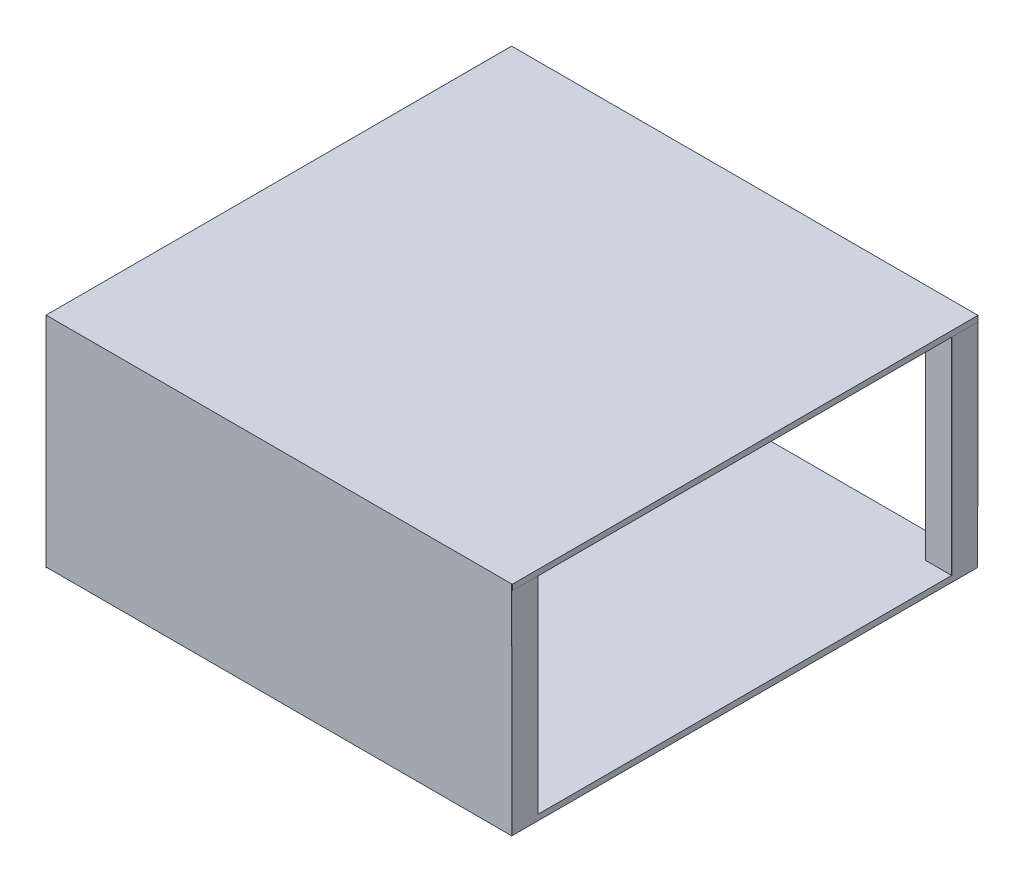
ISO-10303-21;
HEADER;
FILE_DESCRIPTION(('STEP AP214'),'2;1');
FILE_NAME('part.step','',(''),(''),'','','');
FILE_SCHEMA(('AUTOMOTIVE_DESIGN { 1 0 10303 214 1 1 1 1 }'));
ENDSEC;
DATA;
#1=APPLICATION_CONTEXT('core data for automotive mechanical design processes');
#2=APPLICATION_PROTOCOL_DEFINITION('international standard','automotive_design',2000,#1);
#3=PRODUCT_CONTEXT('',#1,'mechanical');
#4=PRODUCT('Part','Part','',(#3));
#5=PRODUCT_RELATED_PRODUCT_CATEGORY('part','',(#4));
#6=PRODUCT_DEFINITION_FORMATION('','',#4);
#7=PRODUCT_DEFINITION_CONTEXT('part definition',#1,'design');
#8=PRODUCT_DEFINITION('design','',#6,#7);
#9=PRODUCT_DEFINITION_SHAPE('','',#8);
#10=(LENGTH_UNIT() NAMED_UNIT(*) SI_UNIT(.MILLI.,.METRE.));
#11=(NAMED_UNIT(*) PLANE_ANGLE_UNIT() SI_UNIT($,.RADIAN.));
#12=(NAMED_UNIT(*) SI_UNIT($,.STERADIAN.) SOLID_ANGLE_UNIT());
#13=UNCERTAINTY_MEASURE_WITH_UNIT(LENGTH_MEASURE(1.E-05),#10,'distance_accuracy_value','');
#14=(GEOMETRIC_REPRESENTATION_CONTEXT(3) GLOBAL_UNCERTAINTY_ASSIGNED_CONTEXT((#13)) GLOBAL_UNIT_ASSIGNED_CONTEXT((#10,
#11,#12)) REPRESENTATION_CONTEXT('',''));
#15=CARTESIAN_POINT('',(0.,0.,0.));
#16=DIRECTION('',(0.,0.,1.));
#17=DIRECTION('',(1.,0.,0.));
#18=AXIS2_PLACEMENT_3D('',#15,#16,#17);
#19=CARTESIAN_POINT('',(0.,11.1125,457.2));
#20=DIRECTION('',(0.,0.,-1.));
#21=DIRECTION('',(-1.,0.,0.));
#22=AXIS2_PLACEMENT_3D('',#19,#20,#21);
#23=PLANE('',#22);
#24=DIRECTION('',(0.,1.,0.));
#25=VECTOR('',#24,1.);
#26=CARTESIAN_POINT('',(457.6375,11.1125,457.2));
#27=LINE('',#26,#25);
#28=CARTESIAN_POINT('',(457.6375,417.5125,457.2));
#29=VERTEX_POINT('',#28);
#30=CARTESIAN_POINT('',(457.6375,428.625,457.2));
#31=VERTEX_POINT('',#30);
#32=EDGE_CURVE('E314',#29,#31,#27,.T.);
#33=ORIENTED_EDGE('',*,*,#32,.F.);
#34=DIRECTION('',(1.,0.,0.));
#35=VECTOR('',#34,1.);
#36=CARTESIAN_POINT('',(-457.2,417.5125,457.2));
#37=LINE('',#36,#35);
#38=CARTESIAN_POINT('',(458.615141898471,417.5125,457.2));
#39=VERTEX_POINT('',#38);
#40=EDGE_CURVE('E350',#29,#39,#37,.T.);
#41=ORIENTED_EDGE('',*,*,#40,.T.);
#42=DIRECTION('',(0.,-1.,0.));
#43=VECTOR('',#42,1.);
#44=CARTESIAN_POINT('',(458.615141898471,428.625,457.2));
#45=LINE('',#44,#43);
#46=CARTESIAN_POINT('',(458.615141898471,428.625,457.2));
#47=VERTEX_POINT('',#46);
#48=EDGE_CURVE('E356',#47,#39,#45,.T.);
#49=ORIENTED_EDGE('',*,*,#48,.F.);
#50=DIRECTION('',(1.,0.,0.));
#51=VECTOR('',#50,1.);
#52=CARTESIAN_POINT('',(-457.2,428.625,457.2));
#53=LINE('',#52,#51);
#54=EDGE_CURVE('E338',#31,#47,#53,.T.);
#55=ORIENTED_EDGE('',*,*,#54,.F.);
#56=EDGE_LOOP('',(#33,#41,#49,#55));
#57=FACE_BOUND('',#56,.T.);
#58=ADVANCED_FACE('F40',(#57),#23,.F.);
#59=CARTESIAN_POINT('',(0.,11.1125,-457.2));
#60=DIRECTION('',(0.,0.,-1.));
#61=DIRECTION('',(-1.,0.,0.));
#62=AXIS2_PLACEMENT_3D('',#59,#60,#61);
#63=PLANE('',#62);
#64=DIRECTION('',(0.,-1.,0.));
#65=VECTOR('',#64,1.);
#66=CARTESIAN_POINT('',(406.4,417.5125,-457.2));
#67=LINE('',#66,#65);
#68=CARTESIAN_POINT('',(406.4,417.5125,-457.2));
#69=VERTEX_POINT('',#68);
#70=CARTESIAN_POINT('',(406.4,11.1125,-457.2));
#71=VERTEX_POINT('',#70);
#72=EDGE_CURVE('E390',#69,#71,#67,.T.);
#73=ORIENTED_EDGE('',*,*,#72,.F.);
#74=DIRECTION('',(-1.,0.,0.));
#75=VECTOR('',#74,1.);
#76=CARTESIAN_POINT('',(-457.2,417.5125,-457.2));
#77=LINE('',#76,#75);
#78=CARTESIAN_POINT('',(-406.4,417.5125,-457.2));
#79=VERTEX_POINT('',#78);
#80=EDGE_CURVE('E331',#69,#79,#77,.T.);
#81=ORIENTED_EDGE('',*,*,#80,.T.);
#82=DIRECTION('',(0.,-1.,0.));
#83=VECTOR('',#82,1.);
#84=CARTESIAN_POINT('',(-406.4,417.5125,-457.2));
#85=LINE('',#84,#83);
#86=CARTESIAN_POINT('',(-406.4,11.1125,-457.2));
#87=VERTEX_POINT('',#86);
#88=EDGE_CURVE('E365',#79,#87,#85,.T.);
#89=ORIENTED_EDGE('',*,*,#88,.T.);
#90=DIRECTION('',(1.,0.,0.));
#91=VECTOR('',#90,1.);
#92=CARTESIAN_POINT('',(0.,11.1125,-457.2));
#93=LINE('',#92,#91);
#94=EDGE_CURVE('E442',#87,#71,#93,.T.);
#95=ORIENTED_EDGE('',*,*,#94,.T.);
#96=EDGE_LOOP('',(#73,#81,#89,#95));
#97=FACE_BOUND('',#96,.T.);
#98=CARTESIAN_POINT('',(458.615141898471,417.5125,-457.2));
#99=VERTEX_POINT('',#98);
#100=CARTESIAN_POINT('',(457.6375,417.5125,-457.2));
#101=VERTEX_POINT('',#100);
#102=EDGE_CURVE('E345',#99,#101,#77,.T.);
#103=ORIENTED_EDGE('',*,*,#102,.T.);
#104=DIRECTION('',(0.,1.,0.));
#105=VECTOR('',#104,1.);
#106=CARTESIAN_POINT('',(457.6375,11.1125,-457.2));
#107=LINE('',#106,#105);
#108=CARTESIAN_POINT('',(457.6375,427.691666666667,-457.2));
#109=VERTEX_POINT('',#108);
#110=EDGE_CURVE('E311',#101,#109,#107,.T.);
#111=ORIENTED_EDGE('',*,*,#110,.T.);
#112=DIRECTION('',(-1.,0.,0.));
#113=VECTOR('',#112,1.);
#114=CARTESIAN_POINT('',(0.,427.691666666667,-457.2));
#115=LINE('',#114,#113);
#116=CARTESIAN_POINT('',(457.2,427.691666666667,-457.2));
#117=VERTEX_POINT('',#116);
#118=EDGE_CURVE('E306',#109,#117,#115,.T.);
#119=ORIENTED_EDGE('',*,*,#118,.T.);
#120=DIRECTION('',(0.,-1.,0.));
#121=VECTOR('',#120,1.);
#122=CARTESIAN_POINT('',(457.2,417.5125,-457.2));
#123=LINE('',#122,#121);
#124=CARTESIAN_POINT('',(457.2,0.,-457.2));
#125=VERTEX_POINT('',#124);
#126=EDGE_CURVE('E386',#117,#125,#123,.T.);
#127=ORIENTED_EDGE('',*,*,#126,.T.);
#128=DIRECTION('',(1.,0.,0.));
#129=VECTOR('',#128,1.);
#130=CARTESIAN_POINT('',(0.,0.,-457.2));
#131=LINE('',#130,#129);
#132=CARTESIAN_POINT('',(-457.2,0.,-457.2));
#133=VERTEX_POINT('',#132);
#134=EDGE_CURVE('E424',#133,#125,#131,.T.);
#135=ORIENTED_EDGE('',*,*,#134,.F.);
#136=DIRECTION('',(0.,-1.,0.));
#137=VECTOR('',#136,1.);
#138=CARTESIAN_POINT('',(-457.2,417.5125,-457.2));
#139=LINE('',#138,#137);
#140=CARTESIAN_POINT('',(-457.2,428.625,-457.2));
#141=VERTEX_POINT('',#140);
#142=EDGE_CURVE('E366',#141,#133,#139,.T.);
#143=ORIENTED_EDGE('',*,*,#142,.F.);
#144=DIRECTION('',(-1.,0.,0.));
#145=VECTOR('',#144,1.);
#146=CARTESIAN_POINT('',(-457.2,428.625,-457.2));
#147=LINE('',#146,#145);
#148=CARTESIAN_POINT('',(458.615141898471,428.625,-457.2));
#149=VERTEX_POINT('',#148);
#150=EDGE_CURVE('E332',#149,#141,#147,.T.);
#151=ORIENTED_EDGE('',*,*,#150,.F.);
#152=DIRECTION('',(0.,-1.,0.));
#153=VECTOR('',#152,1.);
#154=CARTESIAN_POINT('',(458.615141898471,428.625,-457.2));
#155=LINE('',#154,#153);
#156=EDGE_CURVE('E344',#149,#99,#155,.T.);
#157=ORIENTED_EDGE('',*,*,#156,.T.);
#158=EDGE_LOOP('',(#103,#111,#119,#127,#135,#143,#151,#157));
#159=FACE_BOUND('',#158,.T.);
#160=ADVANCED_FACE('F460',(#97,#159),#63,.T.);
#161=CARTESIAN_POINT('',(0.,417.5125,0.));
#162=DIRECTION('',(0.,-1.,0.));
#163=DIRECTION('',(0.,0.,-1.));
#164=AXIS2_PLACEMENT_3D('',#161,#162,#163);
#165=PLANE('',#164);
#166=DIRECTION('',(-1.,0.,0.));
#167=VECTOR('',#166,1.);
#168=CARTESIAN_POINT('',(457.2,417.5125,-406.4));
#169=LINE('',#168,#167);
#170=CARTESIAN_POINT('',(457.2,417.5125,-406.4));
#171=VERTEX_POINT('',#170);
#172=CARTESIAN_POINT('',(406.4,417.5125,-406.4));
#173=VERTEX_POINT('',#172);
#174=EDGE_CURVE('E379',#171,#173,#169,.T.);
#175=ORIENTED_EDGE('',*,*,#174,.F.);
#176=DIRECTION('',(0.,0.,1.));
#177=VECTOR('',#176,1.);
#178=CARTESIAN_POINT('',(457.2,417.5125,-457.2));
#179=LINE('',#178,#177);
#180=CARTESIAN_POINT('',(457.2,417.5125,-408.510119315903));
#181=VERTEX_POINT('',#180);
#182=EDGE_CURVE('E369',#181,#171,#179,.T.);
#183=ORIENTED_EDGE('',*,*,#182,.F.);
#184=DIRECTION('',(-1.,0.,0.));
#185=VECTOR('',#184,1.);
#186=CARTESIAN_POINT('',(457.6375,417.5125,-408.510119315903));
#187=LINE('',#186,#185);
#188=CARTESIAN_POINT('',(457.6375,417.5125,-408.510119315903));
#189=VERTEX_POINT('',#188);
#190=EDGE_CURVE('E273',#189,#181,#187,.T.);
#191=ORIENTED_EDGE('',*,*,#190,.F.);
#192=DIRECTION('',(0.,0.,-1.));
#193=VECTOR('',#192,1.);
#194=CARTESIAN_POINT('',(457.6375,417.5125,0.));
#195=LINE('',#194,#193);
#196=EDGE_CURVE('E309',#189,#101,#195,.T.);
#197=ORIENTED_EDGE('',*,*,#196,.T.);
#198=ORIENTED_EDGE('',*,*,#102,.F.);
#199=DIRECTION('',(0.,0.,-1.));
#200=VECTOR('',#199,1.);
#201=CARTESIAN_POINT('',(458.615141898471,417.5125,-457.2));
#202=LINE('',#201,#200);
#203=EDGE_CURVE('E336',#39,#99,#202,.T.);
#204=ORIENTED_EDGE('',*,*,#203,.F.);
#205=ORIENTED_EDGE('',*,*,#40,.F.);
#206=CARTESIAN_POINT('',(457.6375,417.5125,406.4));
#207=VERTEX_POINT('',#206);
#208=EDGE_CURVE('E312',#29,#207,#195,.T.);
#209=ORIENTED_EDGE('',*,*,#208,.T.);
#210=DIRECTION('',(-1.,0.,0.));
#211=VECTOR('',#210,1.);
#212=CARTESIAN_POINT('',(457.2,417.5125,406.4));
#213=LINE('',#212,#211);
#214=CARTESIAN_POINT('',(406.4,417.5125,406.4));
#215=VERTEX_POINT('',#214);
#216=EDGE_CURVE('E413',#207,#215,#213,.T.);
#217=ORIENTED_EDGE('',*,*,#216,.T.);
#218=DIRECTION('',(0.,0.,-1.));
#219=VECTOR('',#218,1.);
#220=CARTESIAN_POINT('',(406.4,417.5125,457.2));
#221=LINE('',#220,#219);
#222=CARTESIAN_POINT('',(406.4,417.5125,457.2));
#223=VERTEX_POINT('',#222);
#224=EDGE_CURVE('E410',#223,#215,#221,.T.);
#225=ORIENTED_EDGE('',*,*,#224,.F.);
#226=CARTESIAN_POINT('',(-406.4,417.5125,457.2));
#227=VERTEX_POINT('',#226);
#228=EDGE_CURVE('E352',#227,#223,#37,.T.);
#229=ORIENTED_EDGE('',*,*,#228,.F.);
#230=DIRECTION('',(0.,0.,-1.));
#231=VECTOR('',#230,1.);
#232=CARTESIAN_POINT('',(-406.4,417.5125,457.2));
#233=LINE('',#232,#231);
#234=CARTESIAN_POINT('',(-406.4,417.5125,406.4));
#235=VERTEX_POINT('',#234);
#236=EDGE_CURVE('E389',#227,#235,#233,.T.);
#237=ORIENTED_EDGE('',*,*,#236,.T.);
#238=DIRECTION('',(1.,0.,0.));
#239=VECTOR('',#238,1.);
#240=CARTESIAN_POINT('',(-457.2,417.5125,406.4));
#241=LINE('',#240,#239);
#242=CARTESIAN_POINT('',(-457.2,417.5125,406.4));
#243=VERTEX_POINT('',#242);
#244=EDGE_CURVE('E399',#243,#235,#241,.T.);
#245=ORIENTED_EDGE('',*,*,#244,.F.);
#246=DIRECTION('',(0.,0.,1.));
#247=VECTOR('',#246,1.);
#248=CARTESIAN_POINT('',(-457.2,417.5125,-457.2));
#249=LINE('',#248,#247);
#250=CARTESIAN_POINT('',(-457.2,417.5125,-406.4));
#251=VERTEX_POINT('',#250);
#252=EDGE_CURVE('E348',#251,#243,#249,.T.);
#253=ORIENTED_EDGE('',*,*,#252,.F.);
#254=DIRECTION('',(1.,0.,0.));
#255=VECTOR('',#254,1.);
#256=CARTESIAN_POINT('',(-457.2,417.5125,-406.4));
#257=LINE('',#256,#255);
#258=CARTESIAN_POINT('',(-406.4,417.5125,-406.4));
#259=VERTEX_POINT('',#258);
#260=EDGE_CURVE('E362',#251,#259,#257,.T.);
#261=ORIENTED_EDGE('',*,*,#260,.T.);
#262=DIRECTION('',(0.,0.,1.));
#263=VECTOR('',#262,1.);
#264=CARTESIAN_POINT('',(-406.4,417.5125,-457.2));
#265=LINE('',#264,#263);
#266=EDGE_CURVE('E359',#79,#259,#265,.T.);
#267=ORIENTED_EDGE('',*,*,#266,.F.);
#268=ORIENTED_EDGE('',*,*,#80,.F.);
#269=DIRECTION('',(0.,0.,1.));
#270=VECTOR('',#269,1.);
#271=CARTESIAN_POINT('',(406.4,417.5125,-457.2));
#272=LINE('',#271,#270);
#273=EDGE_CURVE('E382',#69,#173,#272,.T.);
#274=ORIENTED_EDGE('',*,*,#273,.T.);
#275=EDGE_LOOP('',(#175,#183,#191,#197,#198,#204,#205,#209,#217,#225,#229,#237,#245,#253,#261,
#267,#268,#274));
#276=FACE_BOUND('',#275,.T.);
#277=ADVANCED_FACE('F532',(#276),#165,.T.);
#278=CARTESIAN_POINT('',(457.240346880729,428.625,457.6375));
#279=DIRECTION('',(-1.,0.,0.));
#280=DIRECTION('',(0.,0.,1.));
#281=AXIS2_PLACEMENT_3D('',#278,#279,#280);
#282=PLANE('',#281);
#283=DIRECTION('',(0.,-0.999999479080298,0.00102070521340941));
#284=VECTOR('',#283,1.);
#285=CARTESIAN_POINT('',(457.240346880729,428.624553441702,457.200000455805));
#286=LINE('',#285,#284);
#287=CARTESIAN_POINT('',(457.240346880729,428.625,457.2));
#288=VERTEX_POINT('',#287);
#289=CARTESIAN_POINT('',(457.240346880729,0.,457.6375));
#290=VERTEX_POINT('',#289);
#291=EDGE_CURVE('E44',#288,#290,#286,.T.);
#292=ORIENTED_EDGE('',*,*,#291,.F.);
#293=DIRECTION('',(0.,0.,-1.));
#294=VECTOR('',#293,1.);
#295=CARTESIAN_POINT('',(457.240346880729,428.625,457.6375));
#296=LINE('',#295,#294);
#297=CARTESIAN_POINT('',(457.240346880729,428.625,457.6375));
#298=VERTEX_POINT('',#297);
#299=EDGE_CURVE('E328',#298,#288,#296,.T.);
#300=ORIENTED_EDGE('',*,*,#299,.F.);
#301=DIRECTION('',(0.,1.,0.));
#302=VECTOR('',#301,1.);
#303=CARTESIAN_POINT('',(457.240346880729,428.625,457.6375));
#304=LINE('',#303,#302);
#305=EDGE_CURVE('E326',#290,#298,#304,.T.);
#306=ORIENTED_EDGE('',*,*,#305,.F.);
#307=EDGE_LOOP('',(#292,#300,#306));
#308=FACE_BOUND('',#307,.T.);
#309=ADVANCED_FACE('F490',(#308),#282,.F.);
#310=CARTESIAN_POINT('',(-457.2,11.1125,0.));
#311=DIRECTION('',(-1.,0.,0.));
#312=DIRECTION('',(0.,0.,1.));
#313=AXIS2_PLACEMENT_3D('',#310,#311,#312);
#314=PLANE('',#313);
#315=DIRECTION('',(0.,0.000885505062252654,-0.999999607940316));
#316=VECTOR('',#315,1.);
#317=CARTESIAN_POINT('',(-457.2,428.625,-457.2));
#318=LINE('',#317,#316);
#319=CARTESIAN_POINT('',(-457.2,427.815175387039,457.333784144845));
#320=VERTEX_POINT('',#319);
#321=EDGE_CURVE('E257',#320,#141,#318,.T.);
#322=ORIENTED_EDGE('',*,*,#321,.F.);
#323=DIRECTION('',(0.,0.999999607940315,0.000885505062252633));
#324=VECTOR('',#323,1.);
#325=CARTESIAN_POINT('',(-457.2,427.815175387039,457.333784144845));
#326=LINE('',#325,#324);
#327=CARTESIAN_POINT('',(-457.2,0.,456.954951492807));
#328=VERTEX_POINT('',#327);
#329=EDGE_CURVE('E11',#328,#320,#326,.T.);
#330=ORIENTED_EDGE('',*,*,#329,.F.);
#331=DIRECTION('',(0.,0.,-1.));
#332=VECTOR('',#331,1.);
#333=CARTESIAN_POINT('',(-457.2,0.,0.));
#334=LINE('',#333,#332);
#335=CARTESIAN_POINT('',(-457.2,0.,457.6375));
#336=VERTEX_POINT('',#335);
#337=EDGE_CURVE('E450',#336,#328,#334,.T.);
#338=ORIENTED_EDGE('',*,*,#337,.F.);
#339=DIRECTION('',(0.,-1.,0.));
#340=VECTOR('',#339,1.);
#341=CARTESIAN_POINT('',(-457.2,428.625,457.6375));
#342=LINE('',#341,#340);
#343=CARTESIAN_POINT('',(-457.2,428.625,457.6375));
#344=VERTEX_POINT('',#343);
#345=EDGE_CURVE('E320',#344,#336,#342,.T.);
#346=ORIENTED_EDGE('',*,*,#345,.F.);
#347=DIRECTION('',(0.,0.,1.));
#348=VECTOR('',#347,1.);
#349=CARTESIAN_POINT('',(-457.2,428.625,-457.2));
#350=LINE('',#349,#348);
#351=EDGE_CURVE('E335',#141,#344,#350,.T.);
#352=ORIENTED_EDGE('',*,*,#351,.F.);
#353=EDGE_LOOP('',(#322,#330,#338,#346,#352));
#354=FACE_BOUND('',#353,.T.);
#355=ADVANCED_FACE('F42',(#354),#314,.T.);
#356=CARTESIAN_POINT('',(457.2,11.1125,0.));
#357=DIRECTION('',(-1.,0.,0.));
#358=DIRECTION('',(0.,0.,1.));
#359=AXIS2_PLACEMENT_3D('',#356,#357,#358);
#360=PLANE('',#359);
#361=DIRECTION('',(0.,-1.,0.));
#362=VECTOR('',#361,1.);
#363=CARTESIAN_POINT('',(457.2,417.5125,-406.4));
#364=LINE('',#363,#362);
#365=CARTESIAN_POINT('',(457.2,11.1125,-406.4));
#366=VERTEX_POINT('',#365);
#367=EDGE_CURVE('E385',#171,#366,#364,.T.);
#368=ORIENTED_EDGE('',*,*,#367,.T.);
#369=DIRECTION('',(0.,0.,-1.));
#370=VECTOR('',#369,1.);
#371=CARTESIAN_POINT('',(457.2,11.1125,406.4));
#372=LINE('',#371,#370);
#373=CARTESIAN_POINT('',(457.2,11.1125,-408.510119315903));
#374=VERTEX_POINT('',#373);
#375=EDGE_CURVE('E63',#366,#374,#372,.T.);
#376=ORIENTED_EDGE('',*,*,#375,.T.);
#377=DIRECTION('',(0.,1.,0.));
#378=VECTOR('',#377,1.);
#379=CARTESIAN_POINT('',(457.2,417.5125,-408.510119315903));
#380=LINE('',#379,#378);
#381=EDGE_CURVE('E259',#374,#181,#380,.T.);
#382=ORIENTED_EDGE('',*,*,#381,.T.);
#383=ORIENTED_EDGE('',*,*,#182,.T.);
#384=EDGE_LOOP('',(#368,#376,#382,#383));
#385=FACE_BOUND('',#384,.T.);
#386=ADVANCED_FACE('F536',(#385),#360,.F.);
#387=CARTESIAN_POINT('',(0.,11.1125,0.));
#388=DIRECTION('',(0.,1.,0.));
#389=DIRECTION('',(0.,0.,1.));
#390=AXIS2_PLACEMENT_3D('',#387,#388,#389);
#391=PLANE('',#390);
#392=DIRECTION('',(0.,0.,-1.));
#393=VECTOR('',#392,1.);
#394=CARTESIAN_POINT('',(-457.2,11.1125,0.));
#395=LINE('',#394,#393);
#396=CARTESIAN_POINT('',(-457.2,11.1125,406.4));
#397=VERTEX_POINT('',#396);
#398=CARTESIAN_POINT('',(-457.2,11.1125,-406.4));
#399=VERTEX_POINT('',#398);
#400=EDGE_CURVE('E421',#397,#399,#395,.T.);
#401=ORIENTED_EDGE('',*,*,#400,.F.);
#402=DIRECTION('',(1.,0.,0.));
#403=VECTOR('',#402,1.);
#404=CARTESIAN_POINT('',(-2.66453525910039E-12,11.1125,406.400000000003));
#405=LINE('',#404,#403);
#406=CARTESIAN_POINT('',(-406.4,11.1125,406.4));
#407=VERTEX_POINT('',#406);
#408=EDGE_CURVE('E423',#397,#407,#405,.T.);
#409=ORIENTED_EDGE('',*,*,#408,.T.);
#410=DIRECTION('',(0.,0.,-1.));
#411=VECTOR('',#410,1.);
#412=CARTESIAN_POINT('',(-406.4,11.1125,4.44089209850063E-13));
#413=LINE('',#412,#411);
#414=CARTESIAN_POINT('',(-406.4,11.1125,457.2));
#415=VERTEX_POINT('',#414);
#416=EDGE_CURVE('E426',#415,#407,#413,.T.);
#417=ORIENTED_EDGE('',*,*,#416,.F.);
#418=DIRECTION('',(1.,0.,0.));
#419=VECTOR('',#418,1.);
#420=CARTESIAN_POINT('',(0.,11.1125,457.2));
#421=LINE('',#420,#419);
#422=CARTESIAN_POINT('',(406.4,11.1125,457.2));
#423=VERTEX_POINT('',#422);
#424=EDGE_CURVE('E429',#415,#423,#421,.T.);
#425=ORIENTED_EDGE('',*,*,#424,.T.);
#426=DIRECTION('',(0.,0.,-1.));
#427=VECTOR('',#426,1.);
#428=CARTESIAN_POINT('',(406.4,11.1125,0.));
#429=LINE('',#428,#427);
#430=CARTESIAN_POINT('',(406.4,11.1125,406.4));
#431=VERTEX_POINT('',#430);
#432=EDGE_CURVE('E432',#423,#431,#429,.T.);
#433=ORIENTED_EDGE('',*,*,#432,.T.);
#434=DIRECTION('',(-1.,0.,0.));
#435=VECTOR('',#434,1.);
#436=CARTESIAN_POINT('',(0.,11.1125,406.4));
#437=LINE('',#436,#435);
#438=CARTESIAN_POINT('',(457.6375,11.1125,406.4));
#439=VERTEX_POINT('',#438);
#440=EDGE_CURVE('E434',#439,#431,#437,.T.);
#441=ORIENTED_EDGE('',*,*,#440,.F.);
#442=DIRECTION('',(0.,0.,-1.));
#443=VECTOR('',#442,1.);
#444=CARTESIAN_POINT('',(457.6375,11.1125,406.4));
#445=LINE('',#444,#443);
#446=CARTESIAN_POINT('',(457.6375,11.1125,-408.510119315903));
#447=VERTEX_POINT('',#446);
#448=EDGE_CURVE('E268',#439,#447,#445,.T.);
#449=ORIENTED_EDGE('',*,*,#448,.T.);
#450=DIRECTION('',(-1.,0.,0.));
#451=VECTOR('',#450,1.);
#452=CARTESIAN_POINT('',(457.6375,11.1125,-408.510119315903));
#453=LINE('',#452,#451);
#454=EDGE_CURVE('E278',#447,#374,#453,.T.);
#455=ORIENTED_EDGE('',*,*,#454,.T.);
#456=ORIENTED_EDGE('',*,*,#375,.F.);
#457=DIRECTION('',(-1.,0.,0.));
#458=VECTOR('',#457,1.);
#459=CARTESIAN_POINT('',(0.,11.1125,-406.4));
#460=LINE('',#459,#458);
#461=CARTESIAN_POINT('',(406.4,11.1125,-406.4));
#462=VERTEX_POINT('',#461);
#463=EDGE_CURVE('E437',#366,#462,#460,.T.);
#464=ORIENTED_EDGE('',*,*,#463,.T.);
#465=DIRECTION('',(0.,0.,1.));
#466=VECTOR('',#465,1.);
#467=CARTESIAN_POINT('',(406.4,11.1125,0.));
#468=LINE('',#467,#466);
#469=EDGE_CURVE('E439',#71,#462,#468,.T.);
#470=ORIENTED_EDGE('',*,*,#469,.F.);
#471=ORIENTED_EDGE('',*,*,#94,.F.);
#472=DIRECTION('',(0.,0.,1.));
#473=VECTOR('',#472,1.);
#474=CARTESIAN_POINT('',(-406.399999999998,11.1125,2.2204460492503E-12));
#475=LINE('',#474,#473);
#476=CARTESIAN_POINT('',(-406.4,11.1125,-406.4));
#477=VERTEX_POINT('',#476);
#478=EDGE_CURVE('E445',#87,#477,#475,.T.);
#479=ORIENTED_EDGE('',*,*,#478,.T.);
#480=DIRECTION('',(1.,0.,0.));
#481=VECTOR('',#480,1.);
#482=CARTESIAN_POINT('',(8.88178419700122E-13,11.1125,-406.399999999999));
#483=LINE('',#482,#481);
#484=EDGE_CURVE('E447',#399,#477,#483,.T.);
#485=ORIENTED_EDGE('',*,*,#484,.F.);
#486=EDGE_LOOP('',(#401,#409,#417,#425,#433,#441,#449,#455,#456,#464,#470,#471,#479,#485));
#487=FACE_BOUND('',#486,.T.);
#488=ADVANCED_FACE('F538',(#487),#391,.T.);
#489=CARTESIAN_POINT('',(0.,0.,0.));
#490=DIRECTION('',(0.,1.,0.));
#491=DIRECTION('',(0.,0.,1.));
#492=AXIS2_PLACEMENT_3D('',#489,#490,#491);
#493=PLANE('',#492);
#494=DIRECTION('',(0.,0.,-1.));
#495=VECTOR('',#494,1.);
#496=CARTESIAN_POINT('',(457.2,0.,0.));
#497=LINE('',#496,#495);
#498=CARTESIAN_POINT('',(457.2,0.,457.6375));
#499=VERTEX_POINT('',#498);
#500=EDGE_CURVE('E452',#499,#125,#497,.T.);
#501=ORIENTED_EDGE('',*,*,#500,.F.);
#502=DIRECTION('',(1.,0.,0.));
#503=VECTOR('',#502,1.);
#504=CARTESIAN_POINT('',(-457.2,0.,457.6375));
#505=LINE('',#504,#503);
#506=EDGE_CURVE('E323',#336,#499,#505,.T.);
#507=ORIENTED_EDGE('',*,*,#506,.F.);
#508=ORIENTED_EDGE('',*,*,#337,.T.);
#509=EDGE_CURVE('E419',#328,#133,#334,.T.);
#510=ORIENTED_EDGE('',*,*,#509,.T.);
#511=ORIENTED_EDGE('',*,*,#134,.T.);
#512=EDGE_LOOP('',(#501,#507,#508,#510,#511));
#513=FACE_BOUND('',#512,.T.);
#514=ADVANCED_FACE('F456',(#513),#493,.F.);
#515=CARTESIAN_POINT('',(457.2,417.5125,406.4));
#516=DIRECTION('',(0.,0.,1.));
#517=DIRECTION('',(1.,0.,0.));
#518=AXIS2_PLACEMENT_3D('',#515,#516,#517);
#519=PLANE('',#518);
#520=ORIENTED_EDGE('',*,*,#440,.T.);
#521=DIRECTION('',(0.,-1.,0.));
#522=VECTOR('',#521,1.);
#523=CARTESIAN_POINT('',(406.4,417.5125,406.4));
#524=LINE('',#523,#522);
#525=EDGE_CURVE('E416',#215,#431,#524,.T.);
#526=ORIENTED_EDGE('',*,*,#525,.F.);
#527=ORIENTED_EDGE('',*,*,#216,.F.);
#528=DIRECTION('',(0.,-1.,0.));
#529=VECTOR('',#528,1.);
#530=CARTESIAN_POINT('',(457.6375,417.5125,406.4));
#531=LINE('',#530,#529);
#532=EDGE_CURVE('E265',#207,#439,#531,.T.);
#533=ORIENTED_EDGE('',*,*,#532,.T.);
#534=EDGE_LOOP('',(#520,#526,#527,#533));
#535=FACE_BOUND('',#534,.T.);
#536=ADVANCED_FACE('F542',(#535),#519,.F.);
#537=CARTESIAN_POINT('',(406.4,417.5125,457.2));
#538=DIRECTION('',(-1.,0.,0.));
#539=DIRECTION('',(0.,0.,1.));
#540=AXIS2_PLACEMENT_3D('',#537,#538,#539);
#541=PLANE('',#540);
#542=ORIENTED_EDGE('',*,*,#525,.T.);
#543=ORIENTED_EDGE('',*,*,#432,.F.);
#544=DIRECTION('',(0.,-1.,0.));
#545=VECTOR('',#544,1.);
#546=CARTESIAN_POINT('',(406.4,417.5125,457.2));
#547=LINE('',#546,#545);
#548=EDGE_CURVE('E415',#223,#423,#547,.T.);
#549=ORIENTED_EDGE('',*,*,#548,.F.);
#550=ORIENTED_EDGE('',*,*,#224,.T.);
#551=EDGE_LOOP('',(#542,#543,#549,#550));
#552=FACE_BOUND('',#551,.T.);
#553=ADVANCED_FACE('F546',(#552),#541,.T.);
#554=CARTESIAN_POINT('',(-406.4,417.5125,457.2));
#555=DIRECTION('',(-1.,0.,0.));
#556=DIRECTION('',(0.,0.,1.));
#557=AXIS2_PLACEMENT_3D('',#554,#555,#556);
#558=PLANE('',#557);
#559=ORIENTED_EDGE('',*,*,#416,.T.);
#560=DIRECTION('',(0.,-1.,0.));
#561=VECTOR('',#560,1.);
#562=CARTESIAN_POINT('',(-406.4,417.5125,406.4));
#563=LINE('',#562,#561);
#564=EDGE_CURVE('E404',#235,#407,#563,.T.);
#565=ORIENTED_EDGE('',*,*,#564,.F.);
#566=ORIENTED_EDGE('',*,*,#236,.F.);
#567=DIRECTION('',(0.,-1.,0.));
#568=VECTOR('',#567,1.);
#569=CARTESIAN_POINT('',(-406.4,417.5125,457.2));
#570=LINE('',#569,#568);
#571=EDGE_CURVE('E407',#227,#415,#570,.T.);
#572=ORIENTED_EDGE('',*,*,#571,.T.);
#573=EDGE_LOOP('',(#559,#565,#566,#572));
#574=FACE_BOUND('',#573,.T.);
#575=ADVANCED_FACE('F549',(#574),#558,.F.);
#576=CARTESIAN_POINT('',(-457.2,417.5125,406.4));
#577=DIRECTION('',(0.,0.,-1.));
#578=DIRECTION('',(-1.,0.,0.));
#579=AXIS2_PLACEMENT_3D('',#576,#577,#578);
#580=PLANE('',#579);
#581=ORIENTED_EDGE('',*,*,#564,.T.);
#582=ORIENTED_EDGE('',*,*,#408,.F.);
#583=DIRECTION('',(0.,-1.,0.));
#584=VECTOR('',#583,1.);
#585=CARTESIAN_POINT('',(-457.2,417.5125,406.4));
#586=LINE('',#585,#584);
#587=EDGE_CURVE('E402',#243,#397,#586,.T.);
#588=ORIENTED_EDGE('',*,*,#587,.F.);
#589=ORIENTED_EDGE('',*,*,#244,.T.);
#590=EDGE_LOOP('',(#581,#582,#588,#589));
#591=FACE_BOUND('',#590,.T.);
#592=ADVANCED_FACE('F556',(#591),#580,.T.);
#593=CARTESIAN_POINT('',(406.4,417.5125,-457.2));
#594=DIRECTION('',(1.,0.,0.));
#595=DIRECTION('',(0.,0.,-1.));
#596=AXIS2_PLACEMENT_3D('',#593,#594,#595);
#597=PLANE('',#596);
#598=ORIENTED_EDGE('',*,*,#469,.T.);
#599=DIRECTION('',(0.,-1.,0.));
#600=VECTOR('',#599,1.);
#601=CARTESIAN_POINT('',(406.4,417.5125,-406.4));
#602=LINE('',#601,#600);
#603=EDGE_CURVE('E393',#173,#462,#602,.T.);
#604=ORIENTED_EDGE('',*,*,#603,.F.);
#605=ORIENTED_EDGE('',*,*,#273,.F.);
#606=ORIENTED_EDGE('',*,*,#72,.T.);
#607=EDGE_LOOP('',(#598,#604,#605,#606));
#608=FACE_BOUND('',#607,.T.);
#609=ADVANCED_FACE('F560',(#608),#597,.F.);
#610=CARTESIAN_POINT('',(457.2,417.5125,-406.4));
#611=DIRECTION('',(0.,0.,1.));
#612=DIRECTION('',(1.,0.,0.));
#613=AXIS2_PLACEMENT_3D('',#610,#611,#612);
#614=PLANE('',#613);
#615=ORIENTED_EDGE('',*,*,#603,.T.);
#616=ORIENTED_EDGE('',*,*,#463,.F.);
#617=ORIENTED_EDGE('',*,*,#367,.F.);
#618=ORIENTED_EDGE('',*,*,#174,.T.);
#619=EDGE_LOOP('',(#615,#616,#617,#618));
#620=FACE_BOUND('',#619,.T.);
#621=ADVANCED_FACE('F562',(#620),#614,.T.);
#622=CARTESIAN_POINT('',(-457.2,417.5125,-406.4));
#623=DIRECTION('',(0.,0.,-1.));
#624=DIRECTION('',(-1.,0.,0.));
#625=AXIS2_PLACEMENT_3D('',#622,#623,#624);
#626=PLANE('',#625);
#627=ORIENTED_EDGE('',*,*,#484,.T.);
#628=DIRECTION('',(0.,-1.,0.));
#629=VECTOR('',#628,1.);
#630=CARTESIAN_POINT('',(-406.4,417.5125,-406.4));
#631=LINE('',#630,#629);
#632=EDGE_CURVE('E373',#259,#477,#631,.T.);
#633=ORIENTED_EDGE('',*,*,#632,.F.);
#634=ORIENTED_EDGE('',*,*,#260,.F.);
#635=DIRECTION('',(0.,-1.,0.));
#636=VECTOR('',#635,1.);
#637=CARTESIAN_POINT('',(-457.2,417.5125,-406.4));
#638=LINE('',#637,#636);
#639=EDGE_CURVE('E370',#251,#399,#638,.T.);
#640=ORIENTED_EDGE('',*,*,#639,.T.);
#641=EDGE_LOOP('',(#627,#633,#634,#640));
#642=FACE_BOUND('',#641,.T.);
#643=ADVANCED_FACE('F565',(#642),#626,.F.);
#644=CARTESIAN_POINT('',(-406.4,417.5125,-457.2));
#645=DIRECTION('',(1.,0.,0.));
#646=DIRECTION('',(0.,0.,-1.));
#647=AXIS2_PLACEMENT_3D('',#644,#645,#646);
#648=PLANE('',#647);
#649=ORIENTED_EDGE('',*,*,#632,.T.);
#650=ORIENTED_EDGE('',*,*,#478,.F.);
#651=ORIENTED_EDGE('',*,*,#88,.F.);
#652=ORIENTED_EDGE('',*,*,#266,.T.);
#653=EDGE_LOOP('',(#649,#650,#651,#652));
#654=FACE_BOUND('',#653,.T.);
#655=ADVANCED_FACE('F570',(#654),#648,.T.);
#656=CARTESIAN_POINT('',(458.615141898471,428.625,-457.2));
#657=DIRECTION('',(-1.,0.,0.));
#658=DIRECTION('',(0.,0.,1.));
#659=AXIS2_PLACEMENT_3D('',#656,#657,#658);
#660=PLANE('',#659);
#661=ORIENTED_EDGE('',*,*,#203,.T.);
#662=ORIENTED_EDGE('',*,*,#156,.F.);
#663=DIRECTION('',(0.,0.,-1.));
#664=VECTOR('',#663,1.);
#665=CARTESIAN_POINT('',(458.615141898471,428.625,-457.2));
#666=LINE('',#665,#664);
#667=EDGE_CURVE('E342',#47,#149,#666,.T.);
#668=ORIENTED_EDGE('',*,*,#667,.F.);
#669=ORIENTED_EDGE('',*,*,#48,.T.);
#670=EDGE_LOOP('',(#661,#662,#668,#669));
#671=FACE_BOUND('',#670,.T.);
#672=ADVANCED_FACE('F573',(#671),#660,.F.);
#673=CARTESIAN_POINT('',(0.,428.625,0.));
#674=DIRECTION('',(0.,-1.,0.));
#675=DIRECTION('',(0.,0.,-1.));
#676=AXIS2_PLACEMENT_3D('',#673,#674,#675);
#677=PLANE('',#676);
#678=ORIENTED_EDGE('',*,*,#299,.T.);
#679=EDGE_CURVE('E339',#288,#31,#53,.T.);
#680=ORIENTED_EDGE('',*,*,#679,.T.);
#681=ORIENTED_EDGE('',*,*,#54,.T.);
#682=ORIENTED_EDGE('',*,*,#667,.T.);
#683=ORIENTED_EDGE('',*,*,#150,.T.);
#684=ORIENTED_EDGE('',*,*,#351,.T.);
#685=DIRECTION('',(-1.,0.,0.));
#686=VECTOR('',#685,1.);
#687=CARTESIAN_POINT('',(-457.2,428.625,457.6375));
#688=LINE('',#687,#686);
#689=EDGE_CURVE('E317',#298,#344,#688,.T.);
#690=ORIENTED_EDGE('',*,*,#689,.F.);
#691=EDGE_LOOP('',(#678,#680,#681,#682,#683,#684,#690));
#692=FACE_BOUND('',#691,.T.);
#693=ADVANCED_FACE('F493',(#692),#677,.F.);
#694=CARTESIAN_POINT('',(0.,0.,457.6375));
#695=DIRECTION('',(0.,0.,-1.));
#696=DIRECTION('',(-1.,0.,0.));
#697=AXIS2_PLACEMENT_3D('',#694,#695,#696);
#698=PLANE('',#697);
#699=ORIENTED_EDGE('',*,*,#689,.T.);
#700=ORIENTED_EDGE('',*,*,#345,.T.);
#701=ORIENTED_EDGE('',*,*,#506,.T.);
#702=DIRECTION('',(-1.,0.,0.));
#703=VECTOR('',#702,1.);
#704=CARTESIAN_POINT('',(457.6375,0.,457.6375));
#705=LINE('',#704,#703);
#706=EDGE_CURVE('E302',#290,#499,#705,.T.);
#707=ORIENTED_EDGE('',*,*,#706,.F.);
#708=ORIENTED_EDGE('',*,*,#305,.T.);
#709=EDGE_LOOP('',(#699,#700,#701,#707,#708));
#710=FACE_BOUND('',#709,.T.);
#711=ADVANCED_FACE('F497',(#710),#698,.F.);
#712=CARTESIAN_POINT('',(0.,0.,457.2));
#713=DIRECTION('',(0.,0.,-1.));
#714=DIRECTION('',(-1.,0.,0.));
#715=AXIS2_PLACEMENT_3D('',#712,#713,#714);
#716=PLANE('',#715);
#717=ORIENTED_EDGE('',*,*,#571,.F.);
#718=ORIENTED_EDGE('',*,*,#228,.T.);
#719=ORIENTED_EDGE('',*,*,#548,.T.);
#720=ORIENTED_EDGE('',*,*,#424,.F.);
#721=EDGE_LOOP('',(#717,#718,#719,#720));
#722=FACE_BOUND('',#721,.T.);
#723=ADVANCED_FACE('F588',(#722),#716,.T.);
#724=CARTESIAN_POINT('',(457.6375,0.,0.));
#725=DIRECTION('',(-1.,0.,0.));
#726=DIRECTION('',(0.,0.,1.));
#727=AXIS2_PLACEMENT_3D('',#724,#725,#726);
#728=PLANE('',#727);
#729=ORIENTED_EDGE('',*,*,#208,.F.);
#730=ORIENTED_EDGE('',*,*,#32,.T.);
#731=DIRECTION('',(0.,-0.999999479080298,0.00102070521340941));
#732=VECTOR('',#731,1.);
#733=CARTESIAN_POINT('',(457.6375,428.625,457.2));
#734=LINE('',#733,#732);
#735=CARTESIAN_POINT('',(457.6375,0.,457.6375));
#736=VERTEX_POINT('',#735);
#737=EDGE_CURVE('E284',#31,#736,#734,.T.);
#738=ORIENTED_EDGE('',*,*,#737,.T.);
#739=DIRECTION('',(0.,-0.00102070521340941,-0.999999479080298));
#740=VECTOR('',#739,1.);
#741=CARTESIAN_POINT('',(457.6375,0.,457.6375));
#742=LINE('',#741,#740);
#743=CARTESIAN_POINT('',(457.6375,-0.934168145052365,-457.58037696706));
#744=VERTEX_POINT('',#743);
#745=EDGE_CURVE('E287',#736,#744,#742,.T.);
#746=ORIENTED_EDGE('',*,*,#745,.T.);
#747=DIRECTION('',(0.,0.999999479080298,-0.00102070521340941));
#748=VECTOR('',#747,1.);
#749=CARTESIAN_POINT('',(457.6375,427.690831854948,-458.01787696706));
#750=LINE('',#749,#748);
#751=CARTESIAN_POINT('',(457.6375,427.690831854948,-458.01787696706));
#752=VERTEX_POINT('',#751);
#753=EDGE_CURVE('E289',#744,#752,#750,.T.);
#754=ORIENTED_EDGE('',*,*,#753,.T.);
#755=DIRECTION('',(0.,0.00102070521340942,0.999999479080298));
#756=VECTOR('',#755,1.);
#757=CARTESIAN_POINT('',(457.6375,428.625,457.2));
#758=LINE('',#757,#756);
#759=EDGE_CURVE('E281',#752,#109,#758,.T.);
#760=ORIENTED_EDGE('',*,*,#759,.T.);
#761=ORIENTED_EDGE('',*,*,#110,.F.);
#762=ORIENTED_EDGE('',*,*,#196,.F.);
#763=DIRECTION('',(0.,1.,0.));
#764=VECTOR('',#763,1.);
#765=CARTESIAN_POINT('',(457.6375,417.5125,-408.510119315903));
#766=LINE('',#765,#764);
#767=EDGE_CURVE('E271',#447,#189,#766,.T.);
#768=ORIENTED_EDGE('',*,*,#767,.F.);
#769=ORIENTED_EDGE('',*,*,#448,.F.);
#770=ORIENTED_EDGE('',*,*,#532,.F.);
#771=EDGE_LOOP('',(#729,#730,#738,#746,#754,#760,#761,#762,#768,#769,#770));
#772=FACE_BOUND('',#771,.T.);
#773=ADVANCED_FACE('F480',(#772),#728,.F.);
#774=CARTESIAN_POINT('',(457.6375,428.625,457.2));
#775=DIRECTION('',(0.,-0.00102070521340941,-0.999999479080298));
#776=DIRECTION('',(0.,0.999999479080298,-0.00102070521340941));
#777=AXIS2_PLACEMENT_3D('',#774,#775,#776);
#778=PLANE('',#777);
#779=ORIENTED_EDGE('',*,*,#679,.F.);
#780=ORIENTED_EDGE('',*,*,#291,.T.);
#781=EDGE_CURVE('E303',#736,#290,#705,.T.);
#782=ORIENTED_EDGE('',*,*,#781,.F.);
#783=ORIENTED_EDGE('',*,*,#737,.F.);
#784=EDGE_LOOP('',(#779,#780,#782,#783));
#785=FACE_BOUND('',#784,.T.);
#786=ADVANCED_FACE('F487',(#785),#778,.F.);
#787=CARTESIAN_POINT('',(457.2,0.,0.));
#788=DIRECTION('',(-1.,0.,0.));
#789=DIRECTION('',(0.,0.,1.));
#790=AXIS2_PLACEMENT_3D('',#787,#788,#789);
#791=PLANE('',#790);
#792=ORIENTED_EDGE('',*,*,#500,.T.);
#793=ORIENTED_EDGE('',*,*,#126,.F.);
#794=DIRECTION('',(0.,0.00102070521340942,0.999999479080298));
#795=VECTOR('',#794,1.);
#796=CARTESIAN_POINT('',(457.2,428.625,457.2));
#797=LINE('',#796,#795);
#798=CARTESIAN_POINT('',(457.2,427.690831854948,-458.01787696706));
#799=VERTEX_POINT('',#798);
#800=EDGE_CURVE('E280',#799,#117,#797,.T.);
#801=ORIENTED_EDGE('',*,*,#800,.F.);
#802=DIRECTION('',(0.,0.999999479080298,-0.00102070521340941));
#803=VECTOR('',#802,1.);
#804=CARTESIAN_POINT('',(457.2,427.690831854948,-458.01787696706));
#805=LINE('',#804,#803);
#806=CARTESIAN_POINT('',(457.2,-0.934168145052365,-457.58037696706));
#807=VERTEX_POINT('',#806);
#808=EDGE_CURVE('E285',#807,#799,#805,.T.);
#809=ORIENTED_EDGE('',*,*,#808,.F.);
#810=DIRECTION('',(0.,-0.00102070521340941,-0.999999479080298));
#811=VECTOR('',#810,1.);
#812=CARTESIAN_POINT('',(457.2,0.,457.6375));
#813=LINE('',#812,#811);
#814=EDGE_CURVE('E294',#499,#807,#813,.T.);
#815=ORIENTED_EDGE('',*,*,#814,.F.);
#816=EDGE_LOOP('',(#792,#793,#801,#809,#815));
#817=FACE_BOUND('',#816,.T.);
#818=ADVANCED_FACE('F465',(#817),#791,.T.);
#819=CARTESIAN_POINT('',(457.6375,428.625,457.2));
#820=DIRECTION('',(0.,-0.999999479080298,0.00102070521340942));
#821=DIRECTION('',(0.,-0.00102070521340942,-0.999999479080298));
#822=AXIS2_PLACEMENT_3D('',#819,#820,#821);
#823=PLANE('',#822);
#824=ORIENTED_EDGE('',*,*,#118,.F.);
#825=ORIENTED_EDGE('',*,*,#759,.F.);
#826=DIRECTION('',(-1.,0.,0.));
#827=VECTOR('',#826,1.);
#828=CARTESIAN_POINT('',(457.6375,427.690831854948,-458.01787696706));
#829=LINE('',#828,#827);
#830=EDGE_CURVE('E291',#752,#799,#829,.T.);
#831=ORIENTED_EDGE('',*,*,#830,.T.);
#832=ORIENTED_EDGE('',*,*,#800,.T.);
#833=EDGE_LOOP('',(#824,#825,#831,#832));
#834=FACE_BOUND('',#833,.T.);
#835=ADVANCED_FACE('F594',(#834),#823,.F.);
#836=CARTESIAN_POINT('',(457.6375,0.,457.6375));
#837=DIRECTION('',(0.,0.999999479080298,-0.00102070521340941));
#838=DIRECTION('',(0.,0.00102070521340941,0.999999479080298));
#839=AXIS2_PLACEMENT_3D('',#836,#837,#838);
#840=PLANE('',#839);
#841=ORIENTED_EDGE('',*,*,#814,.T.);
#842=DIRECTION('',(-1.,0.,0.));
#843=VECTOR('',#842,1.);
#844=CARTESIAN_POINT('',(457.6375,-0.934168145052365,-457.58037696706));
#845=LINE('',#844,#843);
#846=EDGE_CURVE('E299',#744,#807,#845,.T.);
#847=ORIENTED_EDGE('',*,*,#846,.F.);
#848=ORIENTED_EDGE('',*,*,#745,.F.);
#849=ORIENTED_EDGE('',*,*,#781,.T.);
#850=ORIENTED_EDGE('',*,*,#706,.T.);
#851=EDGE_LOOP('',(#841,#847,#848,#849,#850));
#852=FACE_BOUND('',#851,.T.);
#853=ADVANCED_FACE('F470',(#852),#840,.F.);
#854=CARTESIAN_POINT('',(457.6375,427.690831854948,-458.01787696706));
#855=DIRECTION('',(0.,0.00102070521340941,0.999999479080298));
#856=DIRECTION('',(0.,-0.999999479080298,0.00102070521340941));
#857=AXIS2_PLACEMENT_3D('',#854,#855,#856);
#858=PLANE('',#857);
#859=ORIENTED_EDGE('',*,*,#808,.T.);
#860=ORIENTED_EDGE('',*,*,#830,.F.);
#861=ORIENTED_EDGE('',*,*,#753,.F.);
#862=ORIENTED_EDGE('',*,*,#846,.T.);
#863=EDGE_LOOP('',(#859,#860,#861,#862));
#864=FACE_BOUND('',#863,.T.);
#865=ADVANCED_FACE('F475',(#864),#858,.F.);
#866=CARTESIAN_POINT('',(457.6375,417.5125,-408.510119315903));
#867=DIRECTION('',(0.,0.,1.));
#868=DIRECTION('',(1.,0.,0.));
#869=AXIS2_PLACEMENT_3D('',#866,#867,#868);
#870=PLANE('',#869);
#871=ORIENTED_EDGE('',*,*,#381,.F.);
#872=ORIENTED_EDGE('',*,*,#454,.F.);
#873=ORIENTED_EDGE('',*,*,#767,.T.);
#874=ORIENTED_EDGE('',*,*,#190,.T.);
#875=EDGE_LOOP('',(#871,#872,#873,#874));
#876=FACE_BOUND('',#875,.T.);
#877=ADVANCED_FACE('F604',(#876),#870,.T.);
#878=CARTESIAN_POINT('',(-457.6375,0.,0.));
#879=DIRECTION('',(1.,0.,0.));
#880=DIRECTION('',(0.,0.,-1.));
#881=AXIS2_PLACEMENT_3D('',#878,#879,#880);
#882=PLANE('',#881);
#883=DIRECTION('',(0.,0.000885505062252654,-0.999999607940316));
#884=VECTOR('',#883,1.);
#885=CARTESIAN_POINT('',(-457.6375,428.625,-457.2));
#886=LINE('',#885,#884);
#887=CARTESIAN_POINT('',(-457.6375,427.815175387039,457.333784144845));
#888=VERTEX_POINT('',#887);
#889=CARTESIAN_POINT('',(-457.6375,428.625,-457.2));
#890=VERTEX_POINT('',#889);
#891=EDGE_CURVE('E246',#888,#890,#886,.T.);
#892=ORIENTED_EDGE('',*,*,#891,.T.);
#893=DIRECTION('',(0.,-0.999999607940315,-0.000885505062252633));
#894=VECTOR('',#893,1.);
#895=CARTESIAN_POINT('',(-457.6375,428.625,-457.2));
#896=LINE('',#895,#894);
#897=CARTESIAN_POINT('',(-457.6375,-0.934168145052365,-457.58037696706));
#898=VERTEX_POINT('',#897);
#899=EDGE_CURVE('E235',#890,#898,#896,.T.);
#900=ORIENTED_EDGE('',*,*,#899,.T.);
#901=DIRECTION('',(0.,-0.000885505062252633,0.999999607940316));
#902=VECTOR('',#901,1.);
#903=CARTESIAN_POINT('',(-457.6375,-0.934168145052365,-457.58037696706));
#904=LINE('',#903,#902);
#905=CARTESIAN_POINT('',(-457.6375,-1.74399275801326,456.953407177785));
#906=VERTEX_POINT('',#905);
#907=EDGE_CURVE('E245',#898,#906,#904,.T.);
#908=ORIENTED_EDGE('',*,*,#907,.T.);
#909=DIRECTION('',(0.,0.999999607940315,0.000885505062252633));
#910=VECTOR('',#909,1.);
#911=CARTESIAN_POINT('',(-457.6375,427.815175387039,457.333784144845));
#912=LINE('',#911,#910);
#913=EDGE_CURVE('E251',#906,#888,#912,.T.);
#914=ORIENTED_EDGE('',*,*,#913,.T.);
#915=EDGE_LOOP('',(#892,#900,#908,#914));
#916=FACE_BOUND('',#915,.T.);
#917=ADVANCED_FACE('F249',(#916),#882,.F.);
#918=CARTESIAN_POINT('',(-457.6375,427.815175387039,457.333784144845));
#919=DIRECTION('',(0.,0.000885505062252633,-0.999999607940316));
#920=DIRECTION('',(0.,0.999999607940316,0.000885505062252633));
#921=AXIS2_PLACEMENT_3D('',#918,#919,#920);
#922=PLANE('',#921);
#923=CARTESIAN_POINT('',(-457.2,-1.74399275801326,456.953407177785));
#924=VERTEX_POINT('',#923);
#925=EDGE_CURVE('E50',#924,#328,#326,.T.);
#926=ORIENTED_EDGE('',*,*,#925,.T.);
#927=ORIENTED_EDGE('',*,*,#329,.T.);
#928=DIRECTION('',(1.,0.,0.));
#929=VECTOR('',#928,1.);
#930=CARTESIAN_POINT('',(-457.6375,427.815175387039,457.333784144845));
#931=LINE('',#930,#929);
#932=EDGE_CURVE('E513',#888,#320,#931,.T.);
#933=ORIENTED_EDGE('',*,*,#932,.F.);
#934=ORIENTED_EDGE('',*,*,#913,.F.);
#935=DIRECTION('',(1.,0.,0.));
#936=VECTOR('',#935,1.);
#937=CARTESIAN_POINT('',(-457.6375,-1.74399275801326,456.953407177785));
#938=LINE('',#937,#936);
#939=EDGE_CURVE('E261',#906,#924,#938,.T.);
#940=ORIENTED_EDGE('',*,*,#939,.T.);
#941=EDGE_LOOP('',(#926,#927,#933,#934,#940));
#942=FACE_BOUND('',#941,.T.);
#943=ADVANCED_FACE('F506',(#942),#922,.F.);
#944=CARTESIAN_POINT('',(-457.6375,-0.934168145052365,-457.58037696706));
#945=DIRECTION('',(0.,0.999999607940316,0.000885505062252633));
#946=DIRECTION('',(0.,-0.000885505062252633,0.999999607940316));
#947=AXIS2_PLACEMENT_3D('',#944,#945,#946);
#948=PLANE('',#947);
#949=DIRECTION('',(0.,-0.000885505062252633,0.999999607940316));
#950=VECTOR('',#949,1.);
#951=CARTESIAN_POINT('',(-457.2,-0.934168145052365,-457.58037696706));
#952=LINE('',#951,#950);
#953=CARTESIAN_POINT('',(-457.2,-0.934168145052365,-457.58037696706));
#954=VERTEX_POINT('',#953);
#955=EDGE_CURVE('E508',#954,#924,#952,.T.);
#956=ORIENTED_EDGE('',*,*,#955,.T.);
#957=ORIENTED_EDGE('',*,*,#939,.F.);
#958=ORIENTED_EDGE('',*,*,#907,.F.);
#959=DIRECTION('',(1.,0.,0.));
#960=VECTOR('',#959,1.);
#961=CARTESIAN_POINT('',(-457.6375,-0.934168145052365,-457.58037696706));
#962=LINE('',#961,#960);
#963=EDGE_CURVE('E242',#898,#954,#962,.T.);
#964=ORIENTED_EDGE('',*,*,#963,.T.);
#965=EDGE_LOOP('',(#956,#957,#958,#964));
#966=FACE_BOUND('',#965,.T.);
#967=ADVANCED_FACE('F518',(#966),#948,.F.);
#968=CARTESIAN_POINT('',(-457.6375,428.625,-457.2));
#969=DIRECTION('',(0.,-0.000885505062252633,0.999999607940316));
#970=DIRECTION('',(0.,-0.999999607940316,-0.000885505062252633));
#971=AXIS2_PLACEMENT_3D('',#968,#969,#970);
#972=PLANE('',#971);
#973=DIRECTION('',(0.,-0.999999607940315,-0.000885505062252633));
#974=VECTOR('',#973,1.);
#975=CARTESIAN_POINT('',(-457.2,428.625,-457.2));
#976=LINE('',#975,#974);
#977=EDGE_CURVE('E509',#141,#954,#976,.T.);
#978=ORIENTED_EDGE('',*,*,#977,.T.);
#979=ORIENTED_EDGE('',*,*,#963,.F.);
#980=ORIENTED_EDGE('',*,*,#899,.F.);
#981=DIRECTION('',(1.,0.,0.));
#982=VECTOR('',#981,1.);
#983=CARTESIAN_POINT('',(-457.6375,428.625,-457.2));
#984=LINE('',#983,#982);
#985=EDGE_CURVE('E239',#890,#141,#984,.T.);
#986=ORIENTED_EDGE('',*,*,#985,.T.);
#987=EDGE_LOOP('',(#978,#979,#980,#986));
#988=FACE_BOUND('',#987,.T.);
#989=ADVANCED_FACE('F237',(#988),#972,.F.);
#990=CARTESIAN_POINT('',(-457.6375,428.625,-457.2));
#991=DIRECTION('',(0.,-0.999999607940316,-0.000885505062252654));
#992=DIRECTION('',(0.,0.000885505062252654,-0.999999607940316));
#993=AXIS2_PLACEMENT_3D('',#990,#991,#992);
#994=PLANE('',#993);
#995=ORIENTED_EDGE('',*,*,#321,.T.);
#996=ORIENTED_EDGE('',*,*,#985,.F.);
#997=ORIENTED_EDGE('',*,*,#891,.F.);
#998=ORIENTED_EDGE('',*,*,#932,.T.);
#999=EDGE_LOOP('',(#995,#996,#997,#998));
#1000=FACE_BOUND('',#999,.T.);
#1001=ADVANCED_FACE('F256',(#1000),#994,.F.);
#1002=CARTESIAN_POINT('',(-457.2,0.,0.));
#1003=DIRECTION('',(1.,0.,0.));
#1004=DIRECTION('',(0.,0.,-1.));
#1005=AXIS2_PLACEMENT_3D('',#1002,#1003,#1004);
#1006=PLANE('',#1005);
#1007=ORIENTED_EDGE('',*,*,#509,.F.);
#1008=ORIENTED_EDGE('',*,*,#925,.F.);
#1009=ORIENTED_EDGE('',*,*,#955,.F.);
#1010=ORIENTED_EDGE('',*,*,#977,.F.);
#1011=ORIENTED_EDGE('',*,*,#142,.T.);
#1012=EDGE_LOOP('',(#1007,#1008,#1009,#1010,#1011));
#1013=FACE_BOUND('',#1012,.T.);
#1014=ADVANCED_FACE('F501',(#1013),#1006,.T.);
#1015=ORIENTED_EDGE('',*,*,#639,.F.);
#1016=ORIENTED_EDGE('',*,*,#252,.T.);
#1017=ORIENTED_EDGE('',*,*,#587,.T.);
#1018=ORIENTED_EDGE('',*,*,#400,.T.);
#1019=EDGE_LOOP('',(#1015,#1016,#1017,#1018));
#1020=FACE_BOUND('',#1019,.T.);
#1021=ADVANCED_FACE('F616',(#1020),#1006,.T.);
#1022=CLOSED_SHELL('',(#58,#160,#277,#309,#355,#386,#488,#514,#536,#553,#575,#592,#609,#621,
#643,#655,#672,#693,#711,#723,#773,#786,#818,#835,#853,#865,#877,#917,#943,#967,#989,#1001,
#1014,#1021));
#1023=MANIFOLD_SOLID_BREP('B2',#1022);
#1024=ADVANCED_BREP_SHAPE_REPRESENTATION('',(#18,#1023),#14);
#1025=SHAPE_DEFINITION_REPRESENTATION(#9,#1024);
ENDSEC;
END-ISO-10303-21;
